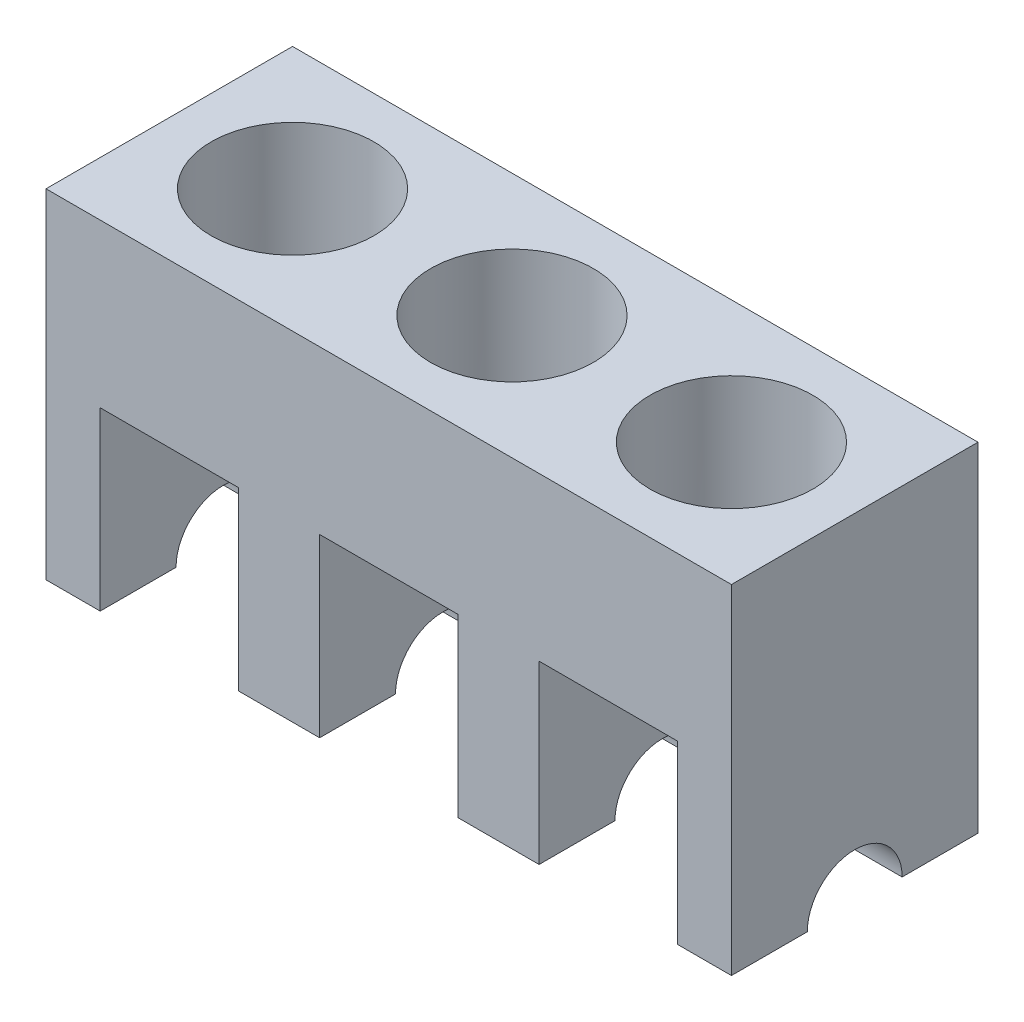
ISO-10303-21;
HEADER;
FILE_DESCRIPTION(('STEP AP214'),'2;1');
FILE_NAME('part.step','',(''),(''),'','','');
FILE_SCHEMA(('AUTOMOTIVE_DESIGN { 1 0 10303 214 1 1 1 1 }'));
ENDSEC;
DATA;
#1=APPLICATION_CONTEXT('core data for automotive mechanical design processes');
#2=APPLICATION_PROTOCOL_DEFINITION('international standard','automotive_design',2000,#1);
#3=PRODUCT_CONTEXT('',#1,'mechanical');
#4=PRODUCT('Part','Part','',(#3));
#5=PRODUCT_RELATED_PRODUCT_CATEGORY('part','',(#4));
#6=PRODUCT_DEFINITION_FORMATION('','',#4);
#7=PRODUCT_DEFINITION_CONTEXT('part definition',#1,'design');
#8=PRODUCT_DEFINITION('design','',#6,#7);
#9=PRODUCT_DEFINITION_SHAPE('','',#8);
#10=(LENGTH_UNIT() NAMED_UNIT(*) SI_UNIT(.MILLI.,.METRE.));
#11=(NAMED_UNIT(*) PLANE_ANGLE_UNIT() SI_UNIT($,.RADIAN.));
#12=(NAMED_UNIT(*) SI_UNIT($,.STERADIAN.) SOLID_ANGLE_UNIT());
#13=UNCERTAINTY_MEASURE_WITH_UNIT(LENGTH_MEASURE(1.E-05),#10,'distance_accuracy_value','');
#14=(GEOMETRIC_REPRESENTATION_CONTEXT(3) GLOBAL_UNCERTAINTY_ASSIGNED_CONTEXT((#13)) GLOBAL_UNIT_ASSIGNED_CONTEXT((#10,
#11,#12)) REPRESENTATION_CONTEXT('',''));
#15=CARTESIAN_POINT('',(0.,0.,0.));
#16=DIRECTION('',(0.,0.,1.));
#17=DIRECTION('',(1.,0.,0.));
#18=AXIS2_PLACEMENT_3D('',#15,#16,#17);
#19=CARTESIAN_POINT('',(0.,0.,0.));
#20=DIRECTION('',(0.,1.,0.));
#21=DIRECTION('',(0.,0.,1.));
#22=AXIS2_PLACEMENT_3D('',#19,#20,#21);
#23=PLANE('',#22);
#24=DIRECTION('',(0.,0.,1.));
#25=VECTOR('',#24,1.);
#26=CARTESIAN_POINT('',(0.,0.,0.));
#27=LINE('',#26,#25);
#28=CARTESIAN_POINT('',(0.,0.,63.));
#29=VERTEX_POINT('',#28);
#30=CARTESIAN_POINT('',(0.,0.,91.));
#31=VERTEX_POINT('',#30);
#32=EDGE_CURVE('E305',#29,#31,#27,.T.);
#33=ORIENTED_EDGE('',*,*,#32,.F.);
#34=DIRECTION('',(1.,0.,0.));
#35=VECTOR('',#34,1.);
#36=CARTESIAN_POINT('',(0.,0.,63.));
#37=LINE('',#36,#35);
#38=CARTESIAN_POINT('',(20.,0.,63.));
#39=VERTEX_POINT('',#38);
#40=EDGE_CURVE('E284',#29,#39,#37,.T.);
#41=ORIENTED_EDGE('',*,*,#40,.T.);
#42=DIRECTION('',(0.,0.,1.));
#43=VECTOR('',#42,1.);
#44=CARTESIAN_POINT('',(20.,0.,0.));
#45=LINE('',#44,#43);
#46=CARTESIAN_POINT('',(20.,0.,91.));
#47=VERTEX_POINT('',#46);
#48=EDGE_CURVE('E428',#39,#47,#45,.T.);
#49=ORIENTED_EDGE('',*,*,#48,.T.);
#50=DIRECTION('',(1.,0.,0.));
#51=VECTOR('',#50,1.);
#52=CARTESIAN_POINT('',(0.,0.,91.));
#53=LINE('',#52,#51);
#54=EDGE_CURVE('E309',#31,#47,#53,.T.);
#55=ORIENTED_EDGE('',*,*,#54,.F.);
#56=EDGE_LOOP('',(#33,#41,#49,#55));
#57=FACE_BOUND('',#56,.T.);
#58=ADVANCED_FACE('F46',(#57),#23,.F.);
#59=DIRECTION('',(0.,0.,1.));
#60=VECTOR('',#59,1.);
#61=CARTESIAN_POINT('',(71.,0.,0.));
#62=LINE('',#61,#60);
#63=CARTESIAN_POINT('',(71.,0.,63.));
#64=VERTEX_POINT('',#63);
#65=CARTESIAN_POINT('',(71.,0.,91.));
#66=VERTEX_POINT('',#65);
#67=EDGE_CURVE('E509',#64,#66,#62,.T.);
#68=ORIENTED_EDGE('',*,*,#67,.F.);
#69=DIRECTION('',(1.,0.,0.));
#70=VECTOR('',#69,1.);
#71=CARTESIAN_POINT('',(0.,0.,63.));
#72=LINE('',#71,#70);
#73=CARTESIAN_POINT('',(101.,0.,63.));
#74=VERTEX_POINT('',#73);
#75=EDGE_CURVE('E918',#64,#74,#72,.T.);
#76=ORIENTED_EDGE('',*,*,#75,.T.);
#77=DIRECTION('',(0.,0.,1.));
#78=VECTOR('',#77,1.);
#79=CARTESIAN_POINT('',(101.,0.,0.));
#80=LINE('',#79,#78);
#81=CARTESIAN_POINT('',(101.,0.,91.));
#82=VERTEX_POINT('',#81);
#83=EDGE_CURVE('E395',#74,#82,#80,.T.);
#84=ORIENTED_EDGE('',*,*,#83,.T.);
#85=EDGE_CURVE('E316',#66,#82,#53,.T.);
#86=ORIENTED_EDGE('',*,*,#85,.F.);
#87=EDGE_LOOP('',(#68,#76,#84,#86));
#88=FACE_BOUND('',#87,.T.);
#89=ADVANCED_FACE('F537',(#88),#23,.F.);
#90=DIRECTION('',(0.,0.,1.));
#91=VECTOR('',#90,1.);
#92=CARTESIAN_POINT('',(152.,0.,0.));
#93=LINE('',#92,#91);
#94=CARTESIAN_POINT('',(152.,0.,63.));
#95=VERTEX_POINT('',#94);
#96=CARTESIAN_POINT('',(152.,0.,91.));
#97=VERTEX_POINT('',#96);
#98=EDGE_CURVE('E445',#95,#97,#93,.T.);
#99=ORIENTED_EDGE('',*,*,#98,.F.);
#100=DIRECTION('',(1.,0.,0.));
#101=VECTOR('',#100,1.);
#102=CARTESIAN_POINT('',(0.,0.,63.));
#103=LINE('',#102,#101);
#104=CARTESIAN_POINT('',(182.,0.,63.));
#105=VERTEX_POINT('',#104);
#106=EDGE_CURVE('E69',#95,#105,#103,.T.);
#107=ORIENTED_EDGE('',*,*,#106,.T.);
#108=DIRECTION('',(0.,0.,1.));
#109=VECTOR('',#108,1.);
#110=CARTESIAN_POINT('',(182.,0.,0.));
#111=LINE('',#110,#109);
#112=CARTESIAN_POINT('',(182.,0.,91.));
#113=VERTEX_POINT('',#112);
#114=EDGE_CURVE('E384',#105,#113,#111,.T.);
#115=ORIENTED_EDGE('',*,*,#114,.T.);
#116=EDGE_CURVE('E307',#97,#113,#53,.T.);
#117=ORIENTED_EDGE('',*,*,#116,.F.);
#118=EDGE_LOOP('',(#99,#107,#115,#117));
#119=FACE_BOUND('',#118,.T.);
#120=ADVANCED_FACE('F546',(#119),#23,.F.);
#121=DIRECTION('',(0.,0.,1.));
#122=VECTOR('',#121,1.);
#123=CARTESIAN_POINT('',(233.,0.,0.));
#124=LINE('',#123,#122);
#125=CARTESIAN_POINT('',(233.,0.,63.));
#126=VERTEX_POINT('',#125);
#127=CARTESIAN_POINT('',(233.,0.,91.));
#128=VERTEX_POINT('',#127);
#129=EDGE_CURVE('E371',#126,#128,#124,.T.);
#130=ORIENTED_EDGE('',*,*,#129,.F.);
#131=DIRECTION('',(1.,0.,0.));
#132=VECTOR('',#131,1.);
#133=CARTESIAN_POINT('',(0.,0.,63.));
#134=LINE('',#133,#132);
#135=CARTESIAN_POINT('',(253.,0.,63.));
#136=VERTEX_POINT('',#135);
#137=EDGE_CURVE('E61',#126,#136,#134,.T.);
#138=ORIENTED_EDGE('',*,*,#137,.T.);
#139=DIRECTION('',(0.,0.,-1.));
#140=VECTOR('',#139,1.);
#141=CARTESIAN_POINT('',(253.,0.,91.));
#142=LINE('',#141,#140);
#143=CARTESIAN_POINT('',(253.,0.,91.));
#144=VERTEX_POINT('',#143);
#145=EDGE_CURVE('E317',#144,#136,#142,.T.);
#146=ORIENTED_EDGE('',*,*,#145,.F.);
#147=EDGE_CURVE('E304',#128,#144,#53,.T.);
#148=ORIENTED_EDGE('',*,*,#147,.F.);
#149=EDGE_LOOP('',(#130,#138,#146,#148));
#150=FACE_BOUND('',#149,.T.);
#151=ADVANCED_FACE('F564',(#150),#23,.F.);
#152=CARTESIAN_POINT('',(182.,65.,0.));
#153=DIRECTION('',(0.,1.,0.));
#154=DIRECTION('',(0.,0.,1.));
#155=AXIS2_PLACEMENT_3D('',#152,#153,#154);
#156=PLANE('',#155);
#157=DIRECTION('',(0.,0.,1.));
#158=VECTOR('',#157,1.);
#159=CARTESIAN_POINT('',(233.,65.,0.));
#160=LINE('',#159,#158);
#161=CARTESIAN_POINT('',(233.,65.,0.));
#162=VERTEX_POINT('',#161);
#163=CARTESIAN_POINT('',(233.,65.,29.6018082789268));
#164=VERTEX_POINT('',#163);
#165=EDGE_CURVE('E359',#162,#164,#160,.T.);
#166=ORIENTED_EDGE('',*,*,#165,.T.);
#167=CARTESIAN_POINT('',(207.5,65.,45.5));
#168=DIRECTION('',(0.,1.,0.));
#169=DIRECTION('',(0.,0.,1.));
#170=AXIS2_PLACEMENT_3D('',#167,#168,#169);
#171=CIRCLE('',#170,30.05);
#172=CARTESIAN_POINT('',(182.,65.,29.6018082789269));
#173=VERTEX_POINT('',#172);
#174=EDGE_CURVE('E366',#164,#173,#171,.T.);
#175=ORIENTED_EDGE('',*,*,#174,.T.);
#176=DIRECTION('',(0.,0.,1.));
#177=VECTOR('',#176,1.);
#178=CARTESIAN_POINT('',(182.,65.,0.));
#179=LINE('',#178,#177);
#180=CARTESIAN_POINT('',(182.,65.,0.));
#181=VERTEX_POINT('',#180);
#182=EDGE_CURVE('E376',#181,#173,#179,.T.);
#183=ORIENTED_EDGE('',*,*,#182,.F.);
#184=DIRECTION('',(-1.,0.,0.));
#185=VECTOR('',#184,1.);
#186=CARTESIAN_POINT('',(182.,65.,0.));
#187=LINE('',#186,#185);
#188=EDGE_CURVE('E369',#162,#181,#187,.T.);
#189=ORIENTED_EDGE('',*,*,#188,.F.);
#190=EDGE_LOOP('',(#166,#175,#183,#189));
#191=FACE_BOUND('',#190,.T.);
#192=ADVANCED_FACE('F365',(#191),#156,.F.);
#193=CARTESIAN_POINT('',(101.,65.,0.));
#194=DIRECTION('',(0.,1.,0.));
#195=DIRECTION('',(0.,0.,1.));
#196=AXIS2_PLACEMENT_3D('',#193,#194,#195);
#197=PLANE('',#196);
#198=DIRECTION('',(0.,0.,1.));
#199=VECTOR('',#198,1.);
#200=CARTESIAN_POINT('',(152.,65.,0.));
#201=LINE('',#200,#199);
#202=CARTESIAN_POINT('',(152.,65.,0.));
#203=VERTEX_POINT('',#202);
#204=CARTESIAN_POINT('',(152.,65.,29.6018082789268));
#205=VERTEX_POINT('',#204);
#206=EDGE_CURVE('E450',#203,#205,#201,.T.);
#207=ORIENTED_EDGE('',*,*,#206,.T.);
#208=CARTESIAN_POINT('',(126.5,65.,45.5));
#209=DIRECTION('',(0.,1.,0.));
#210=DIRECTION('',(0.,0.,1.));
#211=AXIS2_PLACEMENT_3D('',#208,#209,#210);
#212=CIRCLE('',#211,30.05);
#213=CARTESIAN_POINT('',(101.,65.,29.6018082789268));
#214=VERTEX_POINT('',#213);
#215=EDGE_CURVE('E481',#205,#214,#212,.T.);
#216=ORIENTED_EDGE('',*,*,#215,.T.);
#217=DIRECTION('',(0.,0.,1.));
#218=VECTOR('',#217,1.);
#219=CARTESIAN_POINT('',(101.,65.,0.));
#220=LINE('',#219,#218);
#221=CARTESIAN_POINT('',(101.,65.,0.));
#222=VERTEX_POINT('',#221);
#223=EDGE_CURVE('E458',#222,#214,#220,.T.);
#224=ORIENTED_EDGE('',*,*,#223,.F.);
#225=DIRECTION('',(-1.,0.,0.));
#226=VECTOR('',#225,1.);
#227=CARTESIAN_POINT('',(101.,65.,0.));
#228=LINE('',#227,#226);
#229=EDGE_CURVE('E448',#203,#222,#228,.T.);
#230=ORIENTED_EDGE('',*,*,#229,.F.);
#231=EDGE_LOOP('',(#207,#216,#224,#230));
#232=FACE_BOUND('',#231,.T.);
#233=ADVANCED_FACE('F479',(#232),#197,.F.);
#234=CARTESIAN_POINT('',(20.,65.,0.));
#235=DIRECTION('',(0.,1.,0.));
#236=DIRECTION('',(0.,0.,1.));
#237=AXIS2_PLACEMENT_3D('',#234,#235,#236);
#238=PLANE('',#237);
#239=DIRECTION('',(0.,0.,1.));
#240=VECTOR('',#239,1.);
#241=CARTESIAN_POINT('',(71.,65.,0.));
#242=LINE('',#241,#240);
#243=CARTESIAN_POINT('',(71.,65.,0.));
#244=VERTEX_POINT('',#243);
#245=CARTESIAN_POINT('',(71.,65.,29.6018082789268));
#246=VERTEX_POINT('',#245);
#247=EDGE_CURVE('E517',#244,#246,#242,.T.);
#248=ORIENTED_EDGE('',*,*,#247,.T.);
#249=CARTESIAN_POINT('',(45.5,65.,45.5));
#250=DIRECTION('',(0.,1.,0.));
#251=DIRECTION('',(0.,0.,1.));
#252=AXIS2_PLACEMENT_3D('',#249,#250,#251);
#253=CIRCLE('',#252,30.05);
#254=CARTESIAN_POINT('',(20.,65.,29.6018082789268));
#255=VERTEX_POINT('',#254);
#256=EDGE_CURVE('E863',#246,#255,#253,.T.);
#257=ORIENTED_EDGE('',*,*,#256,.T.);
#258=DIRECTION('',(0.,0.,1.));
#259=VECTOR('',#258,1.);
#260=CARTESIAN_POINT('',(20.,65.,0.));
#261=LINE('',#260,#259);
#262=CARTESIAN_POINT('',(20.,65.,0.));
#263=VERTEX_POINT('',#262);
#264=EDGE_CURVE('E514',#263,#255,#261,.T.);
#265=ORIENTED_EDGE('',*,*,#264,.F.);
#266=DIRECTION('',(-1.,0.,0.));
#267=VECTOR('',#266,1.);
#268=CARTESIAN_POINT('',(20.,65.,0.));
#269=LINE('',#268,#267);
#270=EDGE_CURVE('E496',#244,#263,#269,.T.);
#271=ORIENTED_EDGE('',*,*,#270,.F.);
#272=EDGE_LOOP('',(#248,#257,#265,#271));
#273=FACE_BOUND('',#272,.T.);
#274=ADVANCED_FACE('F578',(#273),#238,.F.);
#275=CARTESIAN_POINT('',(20.,0.,0.));
#276=VERTEX_POINT('',#275);
#277=CARTESIAN_POINT('',(20.,0.,28.));
#278=VERTEX_POINT('',#277);
#279=EDGE_CURVE('E298',#276,#278,#45,.T.);
#280=ORIENTED_EDGE('',*,*,#279,.T.);
#281=DIRECTION('',(1.,0.,0.));
#282=VECTOR('',#281,1.);
#283=CARTESIAN_POINT('',(0.,0.,28.));
#284=LINE('',#283,#282);
#285=CARTESIAN_POINT('',(0.,0.,28.));
#286=VERTEX_POINT('',#285);
#287=EDGE_CURVE('E281',#278,#286,#284,.F.);
#288=ORIENTED_EDGE('',*,*,#287,.T.);
#289=CARTESIAN_POINT('',(0.,0.,0.));
#290=VERTEX_POINT('',#289);
#291=EDGE_CURVE('E296',#290,#286,#27,.T.);
#292=ORIENTED_EDGE('',*,*,#291,.F.);
#293=DIRECTION('',(-1.,0.,0.));
#294=VECTOR('',#293,1.);
#295=CARTESIAN_POINT('',(253.,0.,0.));
#296=LINE('',#295,#294);
#297=EDGE_CURVE('E422',#276,#290,#296,.T.);
#298=ORIENTED_EDGE('',*,*,#297,.F.);
#299=EDGE_LOOP('',(#280,#288,#292,#298));
#300=FACE_BOUND('',#299,.T.);
#301=ADVANCED_FACE('F294',(#300),#23,.F.);
#302=CARTESIAN_POINT('',(101.,0.,0.));
#303=VERTEX_POINT('',#302);
#304=CARTESIAN_POINT('',(101.,0.,28.));
#305=VERTEX_POINT('',#304);
#306=EDGE_CURVE('E462',#303,#305,#80,.T.);
#307=ORIENTED_EDGE('',*,*,#306,.T.);
#308=DIRECTION('',(1.,0.,0.));
#309=VECTOR('',#308,1.);
#310=CARTESIAN_POINT('',(0.,0.,28.));
#311=LINE('',#310,#309);
#312=CARTESIAN_POINT('',(71.,0.,28.));
#313=VERTEX_POINT('',#312);
#314=EDGE_CURVE('E288',#305,#313,#311,.F.);
#315=ORIENTED_EDGE('',*,*,#314,.T.);
#316=CARTESIAN_POINT('',(71.,0.,0.));
#317=VERTEX_POINT('',#316);
#318=EDGE_CURVE('E453',#317,#313,#62,.T.);
#319=ORIENTED_EDGE('',*,*,#318,.F.);
#320=EDGE_CURVE('E425',#303,#317,#296,.T.);
#321=ORIENTED_EDGE('',*,*,#320,.F.);
#322=EDGE_LOOP('',(#307,#315,#319,#321));
#323=FACE_BOUND('',#322,.T.);
#324=ADVANCED_FACE('F490',(#323),#23,.F.);
#325=CARTESIAN_POINT('',(182.,0.,0.));
#326=VERTEX_POINT('',#325);
#327=CARTESIAN_POINT('',(182.,0.,28.));
#328=VERTEX_POINT('',#327);
#329=EDGE_CURVE('E381',#326,#328,#111,.T.);
#330=ORIENTED_EDGE('',*,*,#329,.T.);
#331=DIRECTION('',(1.,0.,0.));
#332=VECTOR('',#331,1.);
#333=CARTESIAN_POINT('',(0.,0.,28.));
#334=LINE('',#333,#332);
#335=CARTESIAN_POINT('',(152.,0.,28.));
#336=VERTEX_POINT('',#335);
#337=EDGE_CURVE('E442',#328,#336,#334,.F.);
#338=ORIENTED_EDGE('',*,*,#337,.T.);
#339=CARTESIAN_POINT('',(152.,0.,0.));
#340=VERTEX_POINT('',#339);
#341=EDGE_CURVE('E441',#340,#336,#93,.T.);
#342=ORIENTED_EDGE('',*,*,#341,.F.);
#343=EDGE_CURVE('E427',#326,#340,#296,.T.);
#344=ORIENTED_EDGE('',*,*,#343,.F.);
#345=EDGE_LOOP('',(#330,#338,#342,#344));
#346=FACE_BOUND('',#345,.T.);
#347=ADVANCED_FACE('F438',(#346),#23,.F.);
#348=CARTESIAN_POINT('',(253.,125.,0.));
#349=DIRECTION('',(0.,0.,1.));
#350=DIRECTION('',(1.,0.,0.));
#351=AXIS2_PLACEMENT_3D('',#348,#349,#350);
#352=PLANE('',#351);
#353=ORIENTED_EDGE('',*,*,#270,.T.);
#354=DIRECTION('',(0.,-1.,0.));
#355=VECTOR('',#354,1.);
#356=CARTESIAN_POINT('',(20.,0.,0.));
#357=LINE('',#356,#355);
#358=EDGE_CURVE('E424',#263,#276,#357,.T.);
#359=ORIENTED_EDGE('',*,*,#358,.T.);
#360=ORIENTED_EDGE('',*,*,#297,.T.);
#361=DIRECTION('',(0.,-1.,0.));
#362=VECTOR('',#361,1.);
#363=CARTESIAN_POINT('',(0.,125.,0.));
#364=LINE('',#363,#362);
#365=CARTESIAN_POINT('',(0.,125.,0.));
#366=VERTEX_POINT('',#365);
#367=EDGE_CURVE('E303',#366,#290,#364,.T.);
#368=ORIENTED_EDGE('',*,*,#367,.F.);
#369=DIRECTION('',(-1.,0.,0.));
#370=VECTOR('',#369,1.);
#371=CARTESIAN_POINT('',(253.,125.,0.));
#372=LINE('',#371,#370);
#373=CARTESIAN_POINT('',(253.,125.,0.));
#374=VERTEX_POINT('',#373);
#375=EDGE_CURVE('E320',#374,#366,#372,.T.);
#376=ORIENTED_EDGE('',*,*,#375,.F.);
#377=DIRECTION('',(0.,-1.,0.));
#378=VECTOR('',#377,1.);
#379=CARTESIAN_POINT('',(253.,125.,0.));
#380=LINE('',#379,#378);
#381=CARTESIAN_POINT('',(253.,0.,0.));
#382=VERTEX_POINT('',#381);
#383=EDGE_CURVE('E321',#374,#382,#380,.T.);
#384=ORIENTED_EDGE('',*,*,#383,.T.);
#385=CARTESIAN_POINT('',(233.,0.,0.));
#386=VERTEX_POINT('',#385);
#387=EDGE_CURVE('E310',#382,#386,#296,.T.);
#388=ORIENTED_EDGE('',*,*,#387,.T.);
#389=DIRECTION('',(0.,1.,0.));
#390=VECTOR('',#389,1.);
#391=CARTESIAN_POINT('',(233.,65.,0.));
#392=LINE('',#391,#390);
#393=EDGE_CURVE('E389',#386,#162,#392,.T.);
#394=ORIENTED_EDGE('',*,*,#393,.T.);
#395=ORIENTED_EDGE('',*,*,#188,.T.);
#396=DIRECTION('',(0.,-1.,0.));
#397=VECTOR('',#396,1.);
#398=CARTESIAN_POINT('',(182.,0.,0.));
#399=LINE('',#398,#397);
#400=EDGE_CURVE('E396',#181,#326,#399,.T.);
#401=ORIENTED_EDGE('',*,*,#400,.T.);
#402=ORIENTED_EDGE('',*,*,#343,.T.);
#403=DIRECTION('',(0.,1.,0.));
#404=VECTOR('',#403,1.);
#405=CARTESIAN_POINT('',(152.,65.,0.));
#406=LINE('',#405,#404);
#407=EDGE_CURVE('E434',#340,#203,#406,.T.);
#408=ORIENTED_EDGE('',*,*,#407,.T.);
#409=ORIENTED_EDGE('',*,*,#229,.T.);
#410=DIRECTION('',(0.,-1.,0.));
#411=VECTOR('',#410,1.);
#412=CARTESIAN_POINT('',(101.,0.,0.));
#413=LINE('',#412,#411);
#414=EDGE_CURVE('E444',#222,#303,#413,.T.);
#415=ORIENTED_EDGE('',*,*,#414,.T.);
#416=ORIENTED_EDGE('',*,*,#320,.T.);
#417=DIRECTION('',(0.,1.,0.));
#418=VECTOR('',#417,1.);
#419=CARTESIAN_POINT('',(71.,65.,0.));
#420=LINE('',#419,#418);
#421=EDGE_CURVE('E494',#317,#244,#420,.T.);
#422=ORIENTED_EDGE('',*,*,#421,.T.);
#423=EDGE_LOOP('',(#353,#359,#360,#368,#376,#384,#388,#394,#395,#401,#402,#408,#409,#415,#416,#422));
#424=FACE_BOUND('',#423,.T.);
#425=ADVANCED_FACE('F48',(#424),#352,.F.);
#426=CARTESIAN_POINT('',(0.,125.,0.));
#427=DIRECTION('',(1.,0.,0.));
#428=DIRECTION('',(0.,0.,-1.));
#429=AXIS2_PLACEMENT_3D('',#426,#427,#428);
#430=PLANE('',#429);
#431=ORIENTED_EDGE('',*,*,#291,.T.);
#432=CARTESIAN_POINT('',(0.,0.,45.5));
#433=DIRECTION('',(1.,0.,0.));
#434=DIRECTION('',(0.,0.,-1.));
#435=AXIS2_PLACEMENT_3D('',#432,#433,#434);
#436=CIRCLE('',#435,17.5);
#437=EDGE_CURVE('E278',#286,#29,#436,.T.);
#438=ORIENTED_EDGE('',*,*,#437,.T.);
#439=ORIENTED_EDGE('',*,*,#32,.T.);
#440=DIRECTION('',(0.,-1.,0.));
#441=VECTOR('',#440,1.);
#442=CARTESIAN_POINT('',(0.,125.,91.));
#443=LINE('',#442,#441);
#444=CARTESIAN_POINT('',(0.,125.,91.));
#445=VERTEX_POINT('',#444);
#446=EDGE_CURVE('E328',#445,#31,#443,.T.);
#447=ORIENTED_EDGE('',*,*,#446,.F.);
#448=DIRECTION('',(0.,0.,1.));
#449=VECTOR('',#448,1.);
#450=CARTESIAN_POINT('',(0.,125.,0.));
#451=LINE('',#450,#449);
#452=EDGE_CURVE('E403',#366,#445,#451,.T.);
#453=ORIENTED_EDGE('',*,*,#452,.F.);
#454=ORIENTED_EDGE('',*,*,#367,.T.);
#455=EDGE_LOOP('',(#431,#438,#439,#447,#453,#454));
#456=FACE_BOUND('',#455,.T.);
#457=ADVANCED_FACE('F301',(#456),#430,.F.);
#458=CARTESIAN_POINT('',(0.,125.,91.));
#459=DIRECTION('',(0.,0.,-1.));
#460=DIRECTION('',(-1.,0.,0.));
#461=AXIS2_PLACEMENT_3D('',#458,#459,#460);
#462=PLANE('',#461);
#463=ORIENTED_EDGE('',*,*,#54,.T.);
#464=DIRECTION('',(0.,-1.,0.));
#465=VECTOR('',#464,1.);
#466=CARTESIAN_POINT('',(20.,0.,91.));
#467=LINE('',#466,#465);
#468=CARTESIAN_POINT('',(20.,65.,91.));
#469=VERTEX_POINT('',#468);
#470=EDGE_CURVE('E498',#469,#47,#467,.T.);
#471=ORIENTED_EDGE('',*,*,#470,.F.);
#472=DIRECTION('',(-1.,0.,0.));
#473=VECTOR('',#472,1.);
#474=CARTESIAN_POINT('',(20.,65.,91.));
#475=LINE('',#474,#473);
#476=CARTESIAN_POINT('',(71.,65.,91.));
#477=VERTEX_POINT('',#476);
#478=EDGE_CURVE('E502',#477,#469,#475,.T.);
#479=ORIENTED_EDGE('',*,*,#478,.F.);
#480=DIRECTION('',(0.,1.,0.));
#481=VECTOR('',#480,1.);
#482=CARTESIAN_POINT('',(71.,65.,91.));
#483=LINE('',#482,#481);
#484=EDGE_CURVE('E473',#66,#477,#483,.T.);
#485=ORIENTED_EDGE('',*,*,#484,.F.);
#486=ORIENTED_EDGE('',*,*,#85,.T.);
#487=DIRECTION('',(0.,-1.,0.));
#488=VECTOR('',#487,1.);
#489=CARTESIAN_POINT('',(101.,0.,91.));
#490=LINE('',#489,#488);
#491=CARTESIAN_POINT('',(101.,65.,91.));
#492=VERTEX_POINT('',#491);
#493=EDGE_CURVE('E465',#492,#82,#490,.T.);
#494=ORIENTED_EDGE('',*,*,#493,.F.);
#495=DIRECTION('',(-1.,0.,0.));
#496=VECTOR('',#495,1.);
#497=CARTESIAN_POINT('',(101.,65.,91.));
#498=LINE('',#497,#496);
#499=CARTESIAN_POINT('',(152.,65.,91.));
#500=VERTEX_POINT('',#499);
#501=EDGE_CURVE('E468',#500,#492,#498,.T.);
#502=ORIENTED_EDGE('',*,*,#501,.F.);
#503=DIRECTION('',(0.,1.,0.));
#504=VECTOR('',#503,1.);
#505=CARTESIAN_POINT('',(152.,65.,91.));
#506=LINE('',#505,#504);
#507=EDGE_CURVE('E471',#97,#500,#506,.T.);
#508=ORIENTED_EDGE('',*,*,#507,.F.);
#509=ORIENTED_EDGE('',*,*,#116,.T.);
#510=DIRECTION('',(0.,-1.,0.));
#511=VECTOR('',#510,1.);
#512=CARTESIAN_POINT('',(182.,0.,91.));
#513=LINE('',#512,#511);
#514=CARTESIAN_POINT('',(182.,65.,91.));
#515=VERTEX_POINT('',#514);
#516=EDGE_CURVE('E385',#515,#113,#513,.T.);
#517=ORIENTED_EDGE('',*,*,#516,.F.);
#518=DIRECTION('',(-1.,0.,0.));
#519=VECTOR('',#518,1.);
#520=CARTESIAN_POINT('',(182.,65.,91.));
#521=LINE('',#520,#519);
#522=CARTESIAN_POINT('',(233.,65.,91.));
#523=VERTEX_POINT('',#522);
#524=EDGE_CURVE('E388',#523,#515,#521,.T.);
#525=ORIENTED_EDGE('',*,*,#524,.F.);
#526=DIRECTION('',(0.,1.,0.));
#527=VECTOR('',#526,1.);
#528=CARTESIAN_POINT('',(233.,65.,91.));
#529=LINE('',#528,#527);
#530=EDGE_CURVE('E392',#128,#523,#529,.T.);
#531=ORIENTED_EDGE('',*,*,#530,.F.);
#532=ORIENTED_EDGE('',*,*,#147,.T.);
#533=DIRECTION('',(0.,-1.,0.));
#534=VECTOR('',#533,1.);
#535=CARTESIAN_POINT('',(253.,125.,91.));
#536=LINE('',#535,#534);
#537=CARTESIAN_POINT('',(253.,125.,91.));
#538=VERTEX_POINT('',#537);
#539=EDGE_CURVE('E324',#538,#144,#536,.T.);
#540=ORIENTED_EDGE('',*,*,#539,.F.);
#541=DIRECTION('',(1.,0.,0.));
#542=VECTOR('',#541,1.);
#543=CARTESIAN_POINT('',(0.,125.,91.));
#544=LINE('',#543,#542);
#545=EDGE_CURVE('E405',#445,#538,#544,.T.);
#546=ORIENTED_EDGE('',*,*,#545,.F.);
#547=ORIENTED_EDGE('',*,*,#446,.T.);
#548=EDGE_LOOP('',(#463,#471,#479,#485,#486,#494,#502,#508,#509,#517,#525,#531,#532,#540,#546,#547));
#549=FACE_BOUND('',#548,.T.);
#550=ADVANCED_FACE('F534',(#549),#462,.F.);
#551=CARTESIAN_POINT('',(253.,125.,91.));
#552=DIRECTION('',(-1.,0.,0.));
#553=DIRECTION('',(0.,0.,1.));
#554=AXIS2_PLACEMENT_3D('',#551,#552,#553);
#555=PLANE('',#554);
#556=ORIENTED_EDGE('',*,*,#145,.T.);
#557=CARTESIAN_POINT('',(253.,0.,45.5));
#558=DIRECTION('',(1.,0.,0.));
#559=DIRECTION('',(0.,0.,-1.));
#560=AXIS2_PLACEMENT_3D('',#557,#558,#559);
#561=CIRCLE('',#560,17.5);
#562=CARTESIAN_POINT('',(253.,0.,28.));
#563=VERTEX_POINT('',#562);
#564=EDGE_CURVE('E289',#563,#136,#561,.T.);
#565=ORIENTED_EDGE('',*,*,#564,.F.);
#566=EDGE_CURVE('E315',#563,#382,#142,.T.);
#567=ORIENTED_EDGE('',*,*,#566,.T.);
#568=ORIENTED_EDGE('',*,*,#383,.F.);
#569=DIRECTION('',(0.,0.,-1.));
#570=VECTOR('',#569,1.);
#571=CARTESIAN_POINT('',(253.,125.,91.));
#572=LINE('',#571,#570);
#573=EDGE_CURVE('E325',#538,#374,#572,.T.);
#574=ORIENTED_EDGE('',*,*,#573,.F.);
#575=ORIENTED_EDGE('',*,*,#539,.T.);
#576=EDGE_LOOP('',(#556,#565,#567,#568,#574,#575));
#577=FACE_BOUND('',#576,.T.);
#578=ADVANCED_FACE('F414',(#577),#555,.F.);
#579=CARTESIAN_POINT('',(0.,125.,0.));
#580=DIRECTION('',(0.,1.,0.));
#581=DIRECTION('',(0.,0.,1.));
#582=AXIS2_PLACEMENT_3D('',#579,#580,#581);
#583=PLANE('',#582);
#584=CARTESIAN_POINT('',(45.5,125.,45.5));
#585=DIRECTION('',(0.,1.,0.));
#586=DIRECTION('',(0.,0.,1.));
#587=AXIS2_PLACEMENT_3D('',#584,#585,#586);
#588=CIRCLE('',#587,30.05);
#589=CARTESIAN_POINT('',(45.5,125.,75.55));
#590=VERTEX_POINT('',#589);
#591=EDGE_CURVE('E895',#590,#590,#588,.T.);
#592=ORIENTED_EDGE('',*,*,#591,.F.);
#593=EDGE_LOOP('',(#592));
#594=FACE_BOUND('',#593,.T.);
#595=CARTESIAN_POINT('',(126.5,125.,45.5));
#596=DIRECTION('',(0.,1.,0.));
#597=DIRECTION('',(0.,0.,1.));
#598=AXIS2_PLACEMENT_3D('',#595,#596,#597);
#599=CIRCLE('',#598,30.05);
#600=CARTESIAN_POINT('',(126.5,125.,75.55));
#601=VERTEX_POINT('',#600);
#602=EDGE_CURVE('E898',#601,#601,#599,.T.);
#603=ORIENTED_EDGE('',*,*,#602,.F.);
#604=EDGE_LOOP('',(#603));
#605=FACE_BOUND('',#604,.T.);
#606=CARTESIAN_POINT('',(207.5,125.,45.5));
#607=DIRECTION('',(0.,1.,0.));
#608=DIRECTION('',(0.,0.,1.));
#609=AXIS2_PLACEMENT_3D('',#606,#607,#608);
#610=CIRCLE('',#609,30.05);
#611=CARTESIAN_POINT('',(207.5,125.,75.55));
#612=VERTEX_POINT('',#611);
#613=EDGE_CURVE('E849',#612,#612,#610,.T.);
#614=ORIENTED_EDGE('',*,*,#613,.F.);
#615=EDGE_LOOP('',(#614));
#616=FACE_BOUND('',#615,.T.);
#617=ORIENTED_EDGE('',*,*,#375,.T.);
#618=ORIENTED_EDGE('',*,*,#452,.T.);
#619=ORIENTED_EDGE('',*,*,#545,.T.);
#620=ORIENTED_EDGE('',*,*,#573,.T.);
#621=EDGE_LOOP('',(#617,#618,#619,#620));
#622=FACE_BOUND('',#621,.T.);
#623=ADVANCED_FACE('F409',(#594,#605,#616,#622),#583,.T.);
#624=ORIENTED_EDGE('',*,*,#566,.F.);
#625=DIRECTION('',(1.,0.,0.));
#626=VECTOR('',#625,1.);
#627=CARTESIAN_POINT('',(0.,0.,28.));
#628=LINE('',#627,#626);
#629=CARTESIAN_POINT('',(233.,0.,28.));
#630=VERTEX_POINT('',#629);
#631=EDGE_CURVE('E885',#563,#630,#628,.F.);
#632=ORIENTED_EDGE('',*,*,#631,.T.);
#633=EDGE_CURVE('E374',#386,#630,#124,.T.);
#634=ORIENTED_EDGE('',*,*,#633,.F.);
#635=ORIENTED_EDGE('',*,*,#387,.F.);
#636=EDGE_LOOP('',(#624,#632,#634,#635));
#637=FACE_BOUND('',#636,.T.);
#638=ADVANCED_FACE('F592',(#637),#23,.F.);
#639=CARTESIAN_POINT('',(182.,0.,0.));
#640=DIRECTION('',(-1.,0.,0.));
#641=DIRECTION('',(0.,0.,1.));
#642=AXIS2_PLACEMENT_3D('',#639,#640,#641);
#643=PLANE('',#642);
#644=ORIENTED_EDGE('',*,*,#114,.F.);
#645=CARTESIAN_POINT('',(182.,0.,45.5));
#646=DIRECTION('',(-1.,0.,0.));
#647=DIRECTION('',(0.,0.,1.));
#648=AXIS2_PLACEMENT_3D('',#645,#646,#647);
#649=CIRCLE('',#648,17.5);
#650=EDGE_CURVE('E889',#105,#328,#649,.T.);
#651=ORIENTED_EDGE('',*,*,#650,.T.);
#652=ORIENTED_EDGE('',*,*,#329,.F.);
#653=ORIENTED_EDGE('',*,*,#400,.F.);
#654=ORIENTED_EDGE('',*,*,#182,.T.);
#655=DIRECTION('',(0.,1.,0.));
#656=VECTOR('',#655,1.);
#657=CARTESIAN_POINT('',(182.,44.,29.6018082789269));
#658=LINE('',#657,#656);
#659=CARTESIAN_POINT('',(182.,44.,29.6018082789269));
#660=VERTEX_POINT('',#659);
#661=EDGE_CURVE('E505',#173,#660,#658,.F.);
#662=ORIENTED_EDGE('',*,*,#661,.T.);
#663=DIRECTION('',(0.,0.,-1.));
#664=VECTOR('',#663,1.);
#665=CARTESIAN_POINT('',(182.,44.,0.));
#666=LINE('',#665,#664);
#667=CARTESIAN_POINT('',(182.,44.,61.3981917210731));
#668=VERTEX_POINT('',#667);
#669=EDGE_CURVE('E878',#668,#660,#666,.T.);
#670=ORIENTED_EDGE('',*,*,#669,.F.);
#671=DIRECTION('',(0.,1.,0.));
#672=VECTOR('',#671,1.);
#673=CARTESIAN_POINT('',(182.,44.,61.3981917210731));
#674=LINE('',#673,#672);
#675=CARTESIAN_POINT('',(182.,65.,61.3981917210731));
#676=VERTEX_POINT('',#675);
#677=EDGE_CURVE('E554',#668,#676,#674,.T.);
#678=ORIENTED_EDGE('',*,*,#677,.T.);
#679=EDGE_CURVE('E380',#676,#515,#179,.T.);
#680=ORIENTED_EDGE('',*,*,#679,.T.);
#681=ORIENTED_EDGE('',*,*,#516,.T.);
#682=EDGE_LOOP('',(#644,#651,#652,#653,#654,#662,#670,#678,#680,#681));
#683=FACE_BOUND('',#682,.T.);
#684=ADVANCED_FACE('F550',(#683),#643,.F.);
#685=ORIENTED_EDGE('',*,*,#679,.F.);
#686=CARTESIAN_POINT('',(233.,65.,61.3981917210732));
#687=VERTEX_POINT('',#686);
#688=EDGE_CURVE('E880',#676,#687,#171,.T.);
#689=ORIENTED_EDGE('',*,*,#688,.T.);
#690=EDGE_CURVE('E372',#687,#523,#160,.T.);
#691=ORIENTED_EDGE('',*,*,#690,.T.);
#692=ORIENTED_EDGE('',*,*,#524,.T.);
#693=EDGE_LOOP('',(#685,#689,#691,#692));
#694=FACE_BOUND('',#693,.T.);
#695=ADVANCED_FACE('F557',(#694),#156,.F.);
#696=CARTESIAN_POINT('',(233.,65.,0.));
#697=DIRECTION('',(1.,0.,0.));
#698=DIRECTION('',(0.,0.,-1.));
#699=AXIS2_PLACEMENT_3D('',#696,#697,#698);
#700=PLANE('',#699);
#701=ORIENTED_EDGE('',*,*,#633,.T.);
#702=CARTESIAN_POINT('',(233.,0.,45.5));
#703=DIRECTION('',(1.,0.,0.));
#704=DIRECTION('',(0.,0.,-1.));
#705=AXIS2_PLACEMENT_3D('',#702,#703,#704);
#706=CIRCLE('',#705,17.5);
#707=EDGE_CURVE('E886',#630,#126,#706,.T.);
#708=ORIENTED_EDGE('',*,*,#707,.T.);
#709=ORIENTED_EDGE('',*,*,#129,.T.);
#710=ORIENTED_EDGE('',*,*,#530,.T.);
#711=ORIENTED_EDGE('',*,*,#690,.F.);
#712=DIRECTION('',(0.,1.,0.));
#713=VECTOR('',#712,1.);
#714=CARTESIAN_POINT('',(233.,44.,61.3981917210732));
#715=LINE('',#714,#713);
#716=CARTESIAN_POINT('',(233.,44.,61.3981917210732));
#717=VERTEX_POINT('',#716);
#718=EDGE_CURVE('E350',#687,#717,#715,.F.);
#719=ORIENTED_EDGE('',*,*,#718,.T.);
#720=DIRECTION('',(0.,0.,1.));
#721=VECTOR('',#720,1.);
#722=CARTESIAN_POINT('',(233.,44.,0.));
#723=LINE('',#722,#721);
#724=CARTESIAN_POINT('',(233.,44.,29.6018082789268));
#725=VERTEX_POINT('',#724);
#726=EDGE_CURVE('E348',#725,#717,#723,.T.);
#727=ORIENTED_EDGE('',*,*,#726,.F.);
#728=DIRECTION('',(0.,1.,0.));
#729=VECTOR('',#728,1.);
#730=CARTESIAN_POINT('',(233.,44.,29.6018082789268));
#731=LINE('',#730,#729);
#732=EDGE_CURVE('E54',#725,#164,#731,.T.);
#733=ORIENTED_EDGE('',*,*,#732,.T.);
#734=ORIENTED_EDGE('',*,*,#165,.F.);
#735=ORIENTED_EDGE('',*,*,#393,.F.);
#736=EDGE_LOOP('',(#701,#708,#709,#710,#711,#719,#727,#733,#734,#735));
#737=FACE_BOUND('',#736,.T.);
#738=ADVANCED_FACE('F358',(#737),#700,.F.);
#739=CARTESIAN_POINT('',(101.,0.,0.));
#740=DIRECTION('',(-1.,0.,0.));
#741=DIRECTION('',(0.,0.,1.));
#742=AXIS2_PLACEMENT_3D('',#739,#740,#741);
#743=PLANE('',#742);
#744=ORIENTED_EDGE('',*,*,#83,.F.);
#745=CARTESIAN_POINT('',(101.,0.,45.5));
#746=DIRECTION('',(-1.,0.,0.));
#747=DIRECTION('',(0.,0.,1.));
#748=AXIS2_PLACEMENT_3D('',#745,#746,#747);
#749=CIRCLE('',#748,17.5);
#750=EDGE_CURVE('E487',#74,#305,#749,.T.);
#751=ORIENTED_EDGE('',*,*,#750,.T.);
#752=ORIENTED_EDGE('',*,*,#306,.F.);
#753=ORIENTED_EDGE('',*,*,#414,.F.);
#754=ORIENTED_EDGE('',*,*,#223,.T.);
#755=DIRECTION('',(0.,1.,0.));
#756=VECTOR('',#755,1.);
#757=CARTESIAN_POINT('',(101.,44.,29.6018082789268));
#758=LINE('',#757,#756);
#759=CARTESIAN_POINT('',(101.,44.,29.6018082789268));
#760=VERTEX_POINT('',#759);
#761=EDGE_CURVE('E876',#214,#760,#758,.F.);
#762=ORIENTED_EDGE('',*,*,#761,.T.);
#763=DIRECTION('',(0.,0.,-1.));
#764=VECTOR('',#763,1.);
#765=CARTESIAN_POINT('',(101.,44.,0.));
#766=LINE('',#765,#764);
#767=CARTESIAN_POINT('',(101.,44.,61.3981917210732));
#768=VERTEX_POINT('',#767);
#769=EDGE_CURVE('E868',#768,#760,#766,.T.);
#770=ORIENTED_EDGE('',*,*,#769,.F.);
#771=DIRECTION('',(0.,1.,0.));
#772=VECTOR('',#771,1.);
#773=CARTESIAN_POINT('',(101.,44.,61.3981917210732));
#774=LINE('',#773,#772);
#775=CARTESIAN_POINT('',(101.,65.,61.3981917210732));
#776=VERTEX_POINT('',#775);
#777=EDGE_CURVE('E873',#768,#776,#774,.T.);
#778=ORIENTED_EDGE('',*,*,#777,.T.);
#779=EDGE_CURVE('E461',#776,#492,#220,.T.);
#780=ORIENTED_EDGE('',*,*,#779,.T.);
#781=ORIENTED_EDGE('',*,*,#493,.T.);
#782=EDGE_LOOP('',(#744,#751,#752,#753,#754,#762,#770,#778,#780,#781));
#783=FACE_BOUND('',#782,.T.);
#784=ADVANCED_FACE('F485',(#783),#743,.F.);
#785=ORIENTED_EDGE('',*,*,#779,.F.);
#786=CARTESIAN_POINT('',(152.,65.,61.3981917210732));
#787=VERTEX_POINT('',#786);
#788=EDGE_CURVE('E870',#776,#787,#212,.T.);
#789=ORIENTED_EDGE('',*,*,#788,.T.);
#790=EDGE_CURVE('E457',#787,#500,#201,.T.);
#791=ORIENTED_EDGE('',*,*,#790,.T.);
#792=ORIENTED_EDGE('',*,*,#501,.T.);
#793=EDGE_LOOP('',(#785,#789,#791,#792));
#794=FACE_BOUND('',#793,.T.);
#795=ADVANCED_FACE('F691',(#794),#197,.F.);
#796=CARTESIAN_POINT('',(152.,65.,0.));
#797=DIRECTION('',(1.,0.,0.));
#798=DIRECTION('',(0.,0.,-1.));
#799=AXIS2_PLACEMENT_3D('',#796,#797,#798);
#800=PLANE('',#799);
#801=ORIENTED_EDGE('',*,*,#341,.T.);
#802=CARTESIAN_POINT('',(152.,0.,45.5));
#803=DIRECTION('',(1.,0.,0.));
#804=DIRECTION('',(0.,0.,-1.));
#805=AXIS2_PLACEMENT_3D('',#802,#803,#804);
#806=CIRCLE('',#805,17.5);
#807=EDGE_CURVE('E910',#336,#95,#806,.T.);
#808=ORIENTED_EDGE('',*,*,#807,.T.);
#809=ORIENTED_EDGE('',*,*,#98,.T.);
#810=ORIENTED_EDGE('',*,*,#507,.T.);
#811=ORIENTED_EDGE('',*,*,#790,.F.);
#812=DIRECTION('',(0.,1.,0.));
#813=VECTOR('',#812,1.);
#814=CARTESIAN_POINT('',(152.,44.,61.3981917210732));
#815=LINE('',#814,#813);
#816=CARTESIAN_POINT('',(152.,44.,61.3981917210732));
#817=VERTEX_POINT('',#816);
#818=EDGE_CURVE('E342',#787,#817,#815,.F.);
#819=ORIENTED_EDGE('',*,*,#818,.T.);
#820=DIRECTION('',(0.,0.,1.));
#821=VECTOR('',#820,1.);
#822=CARTESIAN_POINT('',(152.,44.,0.));
#823=LINE('',#822,#821);
#824=CARTESIAN_POINT('',(152.,44.,29.6018082789268));
#825=VERTEX_POINT('',#824);
#826=EDGE_CURVE('E340',#825,#817,#823,.T.);
#827=ORIENTED_EDGE('',*,*,#826,.F.);
#828=DIRECTION('',(0.,1.,0.));
#829=VECTOR('',#828,1.);
#830=CARTESIAN_POINT('',(152.,44.,29.6018082789268));
#831=LINE('',#830,#829);
#832=EDGE_CURVE('E345',#825,#205,#831,.T.);
#833=ORIENTED_EDGE('',*,*,#832,.T.);
#834=ORIENTED_EDGE('',*,*,#206,.F.);
#835=ORIENTED_EDGE('',*,*,#407,.F.);
#836=EDGE_LOOP('',(#801,#808,#809,#810,#811,#819,#827,#833,#834,#835));
#837=FACE_BOUND('',#836,.T.);
#838=ADVANCED_FACE('F587',(#837),#800,.F.);
#839=CARTESIAN_POINT('',(20.,0.,0.));
#840=DIRECTION('',(-1.,0.,0.));
#841=DIRECTION('',(0.,0.,1.));
#842=AXIS2_PLACEMENT_3D('',#839,#840,#841);
#843=PLANE('',#842);
#844=ORIENTED_EDGE('',*,*,#48,.F.);
#845=CARTESIAN_POINT('',(20.,0.,45.5));
#846=DIRECTION('',(-1.,0.,0.));
#847=DIRECTION('',(0.,0.,1.));
#848=AXIS2_PLACEMENT_3D('',#845,#846,#847);
#849=CIRCLE('',#848,17.5);
#850=EDGE_CURVE('E299',#39,#278,#849,.T.);
#851=ORIENTED_EDGE('',*,*,#850,.T.);
#852=ORIENTED_EDGE('',*,*,#279,.F.);
#853=ORIENTED_EDGE('',*,*,#358,.F.);
#854=ORIENTED_EDGE('',*,*,#264,.T.);
#855=DIRECTION('',(0.,1.,0.));
#856=VECTOR('',#855,1.);
#857=CARTESIAN_POINT('',(20.,44.,29.6018082789268));
#858=LINE('',#857,#856);
#859=CARTESIAN_POINT('',(20.,44.,29.6018082789268));
#860=VERTEX_POINT('',#859);
#861=EDGE_CURVE('E865',#255,#860,#858,.F.);
#862=ORIENTED_EDGE('',*,*,#861,.T.);
#863=DIRECTION('',(0.,0.,-1.));
#864=VECTOR('',#863,1.);
#865=CARTESIAN_POINT('',(20.,44.,0.));
#866=LINE('',#865,#864);
#867=CARTESIAN_POINT('',(20.,44.,61.3981917210732));
#868=VERTEX_POINT('',#867);
#869=EDGE_CURVE('E858',#868,#860,#866,.T.);
#870=ORIENTED_EDGE('',*,*,#869,.F.);
#871=DIRECTION('',(0.,1.,0.));
#872=VECTOR('',#871,1.);
#873=CARTESIAN_POINT('',(20.,44.,61.3981917210732));
#874=LINE('',#873,#872);
#875=CARTESIAN_POINT('',(20.,65.,61.3981917210732));
#876=VERTEX_POINT('',#875);
#877=EDGE_CURVE('E574',#868,#876,#874,.T.);
#878=ORIENTED_EDGE('',*,*,#877,.T.);
#879=EDGE_CURVE('E516',#876,#469,#261,.T.);
#880=ORIENTED_EDGE('',*,*,#879,.T.);
#881=ORIENTED_EDGE('',*,*,#470,.T.);
#882=EDGE_LOOP('',(#844,#851,#852,#853,#854,#862,#870,#878,#880,#881));
#883=FACE_BOUND('',#882,.T.);
#884=ADVANCED_FACE('F570',(#883),#843,.F.);
#885=ORIENTED_EDGE('',*,*,#879,.F.);
#886=CARTESIAN_POINT('',(71.,65.,61.3981917210732));
#887=VERTEX_POINT('',#886);
#888=EDGE_CURVE('E860',#876,#887,#253,.T.);
#889=ORIENTED_EDGE('',*,*,#888,.T.);
#890=EDGE_CURVE('E519',#887,#477,#242,.T.);
#891=ORIENTED_EDGE('',*,*,#890,.T.);
#892=ORIENTED_EDGE('',*,*,#478,.T.);
#893=EDGE_LOOP('',(#885,#889,#891,#892));
#894=FACE_BOUND('',#893,.T.);
#895=ADVANCED_FACE('F575',(#894),#238,.F.);
#896=CARTESIAN_POINT('',(71.,65.,0.));
#897=DIRECTION('',(1.,0.,0.));
#898=DIRECTION('',(0.,0.,-1.));
#899=AXIS2_PLACEMENT_3D('',#896,#897,#898);
#900=PLANE('',#899);
#901=ORIENTED_EDGE('',*,*,#318,.T.);
#902=CARTESIAN_POINT('',(71.,0.,45.5));
#903=DIRECTION('',(1.,0.,0.));
#904=DIRECTION('',(0.,0.,-1.));
#905=AXIS2_PLACEMENT_3D('',#902,#903,#904);
#906=CIRCLE('',#905,17.5);
#907=EDGE_CURVE('E11',#313,#64,#906,.T.);
#908=ORIENTED_EDGE('',*,*,#907,.T.);
#909=ORIENTED_EDGE('',*,*,#67,.T.);
#910=ORIENTED_EDGE('',*,*,#484,.T.);
#911=ORIENTED_EDGE('',*,*,#890,.F.);
#912=DIRECTION('',(0.,1.,0.));
#913=VECTOR('',#912,1.);
#914=CARTESIAN_POINT('',(71.,44.,61.3981917210732));
#915=LINE('',#914,#913);
#916=CARTESIAN_POINT('',(71.,44.,61.3981917210732));
#917=VERTEX_POINT('',#916);
#918=EDGE_CURVE('E334',#887,#917,#915,.F.);
#919=ORIENTED_EDGE('',*,*,#918,.T.);
#920=DIRECTION('',(0.,0.,1.));
#921=VECTOR('',#920,1.);
#922=CARTESIAN_POINT('',(71.,44.,0.));
#923=LINE('',#922,#921);
#924=CARTESIAN_POINT('',(71.,44.,29.6018082789268));
#925=VERTEX_POINT('',#924);
#926=EDGE_CURVE('E332',#925,#917,#923,.T.);
#927=ORIENTED_EDGE('',*,*,#926,.F.);
#928=DIRECTION('',(0.,1.,0.));
#929=VECTOR('',#928,1.);
#930=CARTESIAN_POINT('',(71.,44.,29.6018082789268));
#931=LINE('',#930,#929);
#932=EDGE_CURVE('E337',#925,#246,#931,.T.);
#933=ORIENTED_EDGE('',*,*,#932,.T.);
#934=ORIENTED_EDGE('',*,*,#247,.F.);
#935=ORIENTED_EDGE('',*,*,#421,.F.);
#936=EDGE_LOOP('',(#901,#908,#909,#910,#911,#919,#927,#933,#934,#935));
#937=FACE_BOUND('',#936,.T.);
#938=ADVANCED_FACE('F527',(#937),#900,.F.);
#939=CARTESIAN_POINT('',(45.5,44.,45.5));
#940=DIRECTION('',(0.,1.,0.));
#941=DIRECTION('',(0.,0.,1.));
#942=AXIS2_PLACEMENT_3D('',#939,#940,#941);
#943=CYLINDRICAL_SURFACE('',#942,30.05);
#944=ORIENTED_EDGE('',*,*,#591,.T.);
#945=EDGE_LOOP('',(#944));
#946=FACE_BOUND('',#945,.T.);
#947=ORIENTED_EDGE('',*,*,#256,.F.);
#948=ORIENTED_EDGE('',*,*,#932,.F.);
#949=CARTESIAN_POINT('',(45.5,44.,45.5));
#950=DIRECTION('',(0.,1.,0.));
#951=DIRECTION('',(0.,0.,1.));
#952=AXIS2_PLACEMENT_3D('',#949,#950,#951);
#953=CIRCLE('',#952,30.05);
#954=EDGE_CURVE('E861',#917,#925,#953,.T.);
#955=ORIENTED_EDGE('',*,*,#954,.F.);
#956=ORIENTED_EDGE('',*,*,#918,.F.);
#957=ORIENTED_EDGE('',*,*,#888,.F.);
#958=ORIENTED_EDGE('',*,*,#877,.F.);
#959=EDGE_CURVE('E894',#860,#868,#953,.T.);
#960=ORIENTED_EDGE('',*,*,#959,.F.);
#961=ORIENTED_EDGE('',*,*,#861,.F.);
#962=EDGE_LOOP('',(#947,#948,#955,#956,#957,#958,#960,#961));
#963=FACE_BOUND('',#962,.T.);
#964=ADVANCED_FACE('F584',(#946,#963),#943,.F.);
#965=CARTESIAN_POINT('',(45.5,44.,45.5));
#966=DIRECTION('',(0.,1.,0.));
#967=DIRECTION('',(0.,0.,1.));
#968=AXIS2_PLACEMENT_3D('',#965,#966,#967);
#969=PLANE('',#968);
#970=ORIENTED_EDGE('',*,*,#869,.T.);
#971=ORIENTED_EDGE('',*,*,#959,.T.);
#972=EDGE_LOOP('',(#970,#971));
#973=FACE_BOUND('',#972,.T.);
#974=ADVANCED_FACE('F766',(#973),#969,.T.);
#975=ORIENTED_EDGE('',*,*,#926,.T.);
#976=ORIENTED_EDGE('',*,*,#954,.T.);
#977=EDGE_LOOP('',(#975,#976));
#978=FACE_BOUND('',#977,.T.);
#979=ADVANCED_FACE('F775',(#978),#969,.T.);
#980=CARTESIAN_POINT('',(126.5,44.,45.5));
#981=DIRECTION('',(0.,1.,0.));
#982=DIRECTION('',(0.,0.,1.));
#983=AXIS2_PLACEMENT_3D('',#980,#981,#982);
#984=CYLINDRICAL_SURFACE('',#983,30.05);
#985=ORIENTED_EDGE('',*,*,#602,.T.);
#986=EDGE_LOOP('',(#985));
#987=FACE_BOUND('',#986,.T.);
#988=ORIENTED_EDGE('',*,*,#215,.F.);
#989=ORIENTED_EDGE('',*,*,#832,.F.);
#990=CARTESIAN_POINT('',(126.5,44.,45.5));
#991=DIRECTION('',(0.,1.,0.));
#992=DIRECTION('',(0.,0.,1.));
#993=AXIS2_PLACEMENT_3D('',#990,#991,#992);
#994=CIRCLE('',#993,30.05);
#995=EDGE_CURVE('E900',#817,#825,#994,.T.);
#996=ORIENTED_EDGE('',*,*,#995,.F.);
#997=ORIENTED_EDGE('',*,*,#818,.F.);
#998=ORIENTED_EDGE('',*,*,#788,.F.);
#999=ORIENTED_EDGE('',*,*,#777,.F.);
#1000=EDGE_CURVE('E853',#760,#768,#994,.T.);
#1001=ORIENTED_EDGE('',*,*,#1000,.F.);
#1002=ORIENTED_EDGE('',*,*,#761,.F.);
#1003=EDGE_LOOP('',(#988,#989,#996,#997,#998,#999,#1001,#1002));
#1004=FACE_BOUND('',#1003,.T.);
#1005=ADVANCED_FACE('F784',(#987,#1004),#984,.F.);
#1006=CARTESIAN_POINT('',(126.5,44.,45.5));
#1007=DIRECTION('',(0.,1.,0.));
#1008=DIRECTION('',(0.,0.,1.));
#1009=AXIS2_PLACEMENT_3D('',#1006,#1007,#1008);
#1010=PLANE('',#1009);
#1011=ORIENTED_EDGE('',*,*,#769,.T.);
#1012=ORIENTED_EDGE('',*,*,#1000,.T.);
#1013=EDGE_LOOP('',(#1011,#1012));
#1014=FACE_BOUND('',#1013,.T.);
#1015=ADVANCED_FACE('F792',(#1014),#1010,.T.);
#1016=ORIENTED_EDGE('',*,*,#826,.T.);
#1017=ORIENTED_EDGE('',*,*,#995,.T.);
#1018=EDGE_LOOP('',(#1016,#1017));
#1019=FACE_BOUND('',#1018,.T.);
#1020=ADVANCED_FACE('F801',(#1019),#1010,.T.);
#1021=CARTESIAN_POINT('',(207.5,44.,45.5));
#1022=DIRECTION('',(0.,1.,0.));
#1023=DIRECTION('',(0.,0.,1.));
#1024=AXIS2_PLACEMENT_3D('',#1021,#1022,#1023);
#1025=CYLINDRICAL_SURFACE('',#1024,30.05);
#1026=ORIENTED_EDGE('',*,*,#613,.T.);
#1027=EDGE_LOOP('',(#1026));
#1028=FACE_BOUND('',#1027,.T.);
#1029=ORIENTED_EDGE('',*,*,#174,.F.);
#1030=ORIENTED_EDGE('',*,*,#732,.F.);
#1031=CARTESIAN_POINT('',(207.5,44.,45.5));
#1032=DIRECTION('',(0.,1.,0.));
#1033=DIRECTION('',(0.,0.,1.));
#1034=AXIS2_PLACEMENT_3D('',#1031,#1032,#1033);
#1035=CIRCLE('',#1034,30.05);
#1036=EDGE_CURVE('E848',#717,#725,#1035,.T.);
#1037=ORIENTED_EDGE('',*,*,#1036,.F.);
#1038=ORIENTED_EDGE('',*,*,#718,.F.);
#1039=ORIENTED_EDGE('',*,*,#688,.F.);
#1040=ORIENTED_EDGE('',*,*,#677,.F.);
#1041=EDGE_CURVE('E850',#660,#668,#1035,.T.);
#1042=ORIENTED_EDGE('',*,*,#1041,.F.);
#1043=ORIENTED_EDGE('',*,*,#661,.F.);
#1044=EDGE_LOOP('',(#1029,#1030,#1037,#1038,#1039,#1040,#1042,#1043));
#1045=FACE_BOUND('',#1044,.T.);
#1046=ADVANCED_FACE('F810',(#1028,#1045),#1025,.F.);
#1047=CARTESIAN_POINT('',(207.5,44.,45.5));
#1048=DIRECTION('',(0.,1.,0.));
#1049=DIRECTION('',(0.,0.,1.));
#1050=AXIS2_PLACEMENT_3D('',#1047,#1048,#1049);
#1051=PLANE('',#1050);
#1052=ORIENTED_EDGE('',*,*,#669,.T.);
#1053=ORIENTED_EDGE('',*,*,#1041,.T.);
#1054=EDGE_LOOP('',(#1052,#1053));
#1055=FACE_BOUND('',#1054,.T.);
#1056=ADVANCED_FACE('F818',(#1055),#1051,.T.);
#1057=ORIENTED_EDGE('',*,*,#726,.T.);
#1058=ORIENTED_EDGE('',*,*,#1036,.T.);
#1059=EDGE_LOOP('',(#1057,#1058));
#1060=FACE_BOUND('',#1059,.T.);
#1061=ADVANCED_FACE('F648',(#1060),#1051,.T.);
#1062=CARTESIAN_POINT('',(0.,0.,45.5));
#1063=DIRECTION('',(1.,0.,0.));
#1064=DIRECTION('',(0.,0.,-1.));
#1065=AXIS2_PLACEMENT_3D('',#1062,#1063,#1064);
#1066=CYLINDRICAL_SURFACE('',#1065,17.5);
#1067=ORIENTED_EDGE('',*,*,#75,.F.);
#1068=ORIENTED_EDGE('',*,*,#907,.F.);
#1069=ORIENTED_EDGE('',*,*,#314,.F.);
#1070=ORIENTED_EDGE('',*,*,#750,.F.);
#1071=EDGE_LOOP('',(#1067,#1068,#1069,#1070));
#1072=FACE_BOUND('',#1071,.T.);
#1073=ADVANCED_FACE('F644',(#1072),#1066,.F.);
#1074=ORIENTED_EDGE('',*,*,#437,.F.);
#1075=ORIENTED_EDGE('',*,*,#287,.F.);
#1076=ORIENTED_EDGE('',*,*,#850,.F.);
#1077=ORIENTED_EDGE('',*,*,#40,.F.);
#1078=EDGE_LOOP('',(#1074,#1075,#1076,#1077));
#1079=FACE_BOUND('',#1078,.T.);
#1080=ADVANCED_FACE('F280',(#1079),#1066,.F.);
#1081=ORIENTED_EDGE('',*,*,#106,.F.);
#1082=ORIENTED_EDGE('',*,*,#807,.F.);
#1083=ORIENTED_EDGE('',*,*,#337,.F.);
#1084=ORIENTED_EDGE('',*,*,#650,.F.);
#1085=EDGE_LOOP('',(#1081,#1082,#1083,#1084));
#1086=FACE_BOUND('',#1085,.T.);
#1087=ADVANCED_FACE('F658',(#1086),#1066,.F.);
#1088=ORIENTED_EDGE('',*,*,#707,.F.);
#1089=ORIENTED_EDGE('',*,*,#631,.F.);
#1090=ORIENTED_EDGE('',*,*,#564,.T.);
#1091=ORIENTED_EDGE('',*,*,#137,.F.);
#1092=EDGE_LOOP('',(#1088,#1089,#1090,#1091));
#1093=FACE_BOUND('',#1092,.T.);
#1094=ADVANCED_FACE('F651',(#1093),#1066,.F.);
#1095=CLOSED_SHELL('',(#58,#89,#120,#151,#192,#233,#274,#301,#324,#347,#425,#457,#550,#578,#623,
#638,#684,#695,#738,#784,#795,#838,#884,#895,#938,#964,#974,#979,#1005,#1015,#1020,#1046,#1056,
#1061,#1073,#1080,#1087,#1094));
#1096=MANIFOLD_SOLID_BREP('B2',#1095);
#1097=ADVANCED_BREP_SHAPE_REPRESENTATION('',(#18,#1096),#14);
#1098=SHAPE_DEFINITION_REPRESENTATION(#9,#1097);
ENDSEC;
END-ISO-10303-21;
